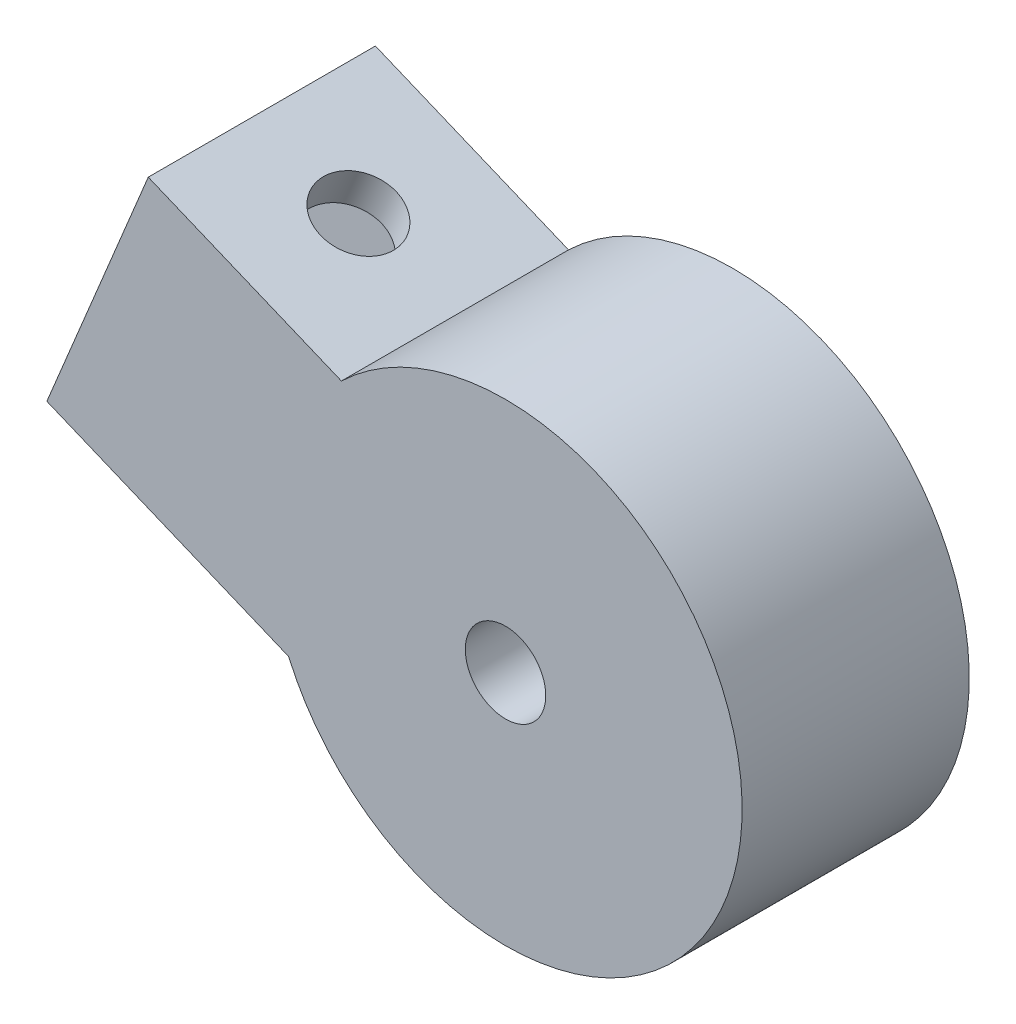
ISO-10303-21;
HEADER;
FILE_DESCRIPTION(('STEP AP214'),'2;1');
FILE_NAME('part.step','',(''),(''),'','','');
FILE_SCHEMA(('AUTOMOTIVE_DESIGN { 1 0 10303 214 1 1 1 1 }'));
ENDSEC;
DATA;
#1=APPLICATION_CONTEXT('core data for automotive mechanical design processes');
#2=APPLICATION_PROTOCOL_DEFINITION('international standard','automotive_design',2000,#1);
#3=PRODUCT_CONTEXT('',#1,'mechanical');
#4=PRODUCT('Part','Part','',(#3));
#5=PRODUCT_RELATED_PRODUCT_CATEGORY('part','',(#4));
#6=PRODUCT_DEFINITION_FORMATION('','',#4);
#7=PRODUCT_DEFINITION_CONTEXT('part definition',#1,'design');
#8=PRODUCT_DEFINITION('design','',#6,#7);
#9=PRODUCT_DEFINITION_SHAPE('','',#8);
#10=(LENGTH_UNIT() NAMED_UNIT(*) SI_UNIT(.MILLI.,.METRE.));
#11=(NAMED_UNIT(*) PLANE_ANGLE_UNIT() SI_UNIT($,.RADIAN.));
#12=(NAMED_UNIT(*) SI_UNIT($,.STERADIAN.) SOLID_ANGLE_UNIT());
#13=UNCERTAINTY_MEASURE_WITH_UNIT(LENGTH_MEASURE(1.E-05),#10,'distance_accuracy_value','');
#14=(GEOMETRIC_REPRESENTATION_CONTEXT(3) GLOBAL_UNCERTAINTY_ASSIGNED_CONTEXT((#13)) GLOBAL_UNIT_ASSIGNED_CONTEXT((#10,
#11,#12)) REPRESENTATION_CONTEXT('',''));
#15=CARTESIAN_POINT('',(0.,0.,0.));
#16=DIRECTION('',(0.,0.,1.));
#17=DIRECTION('',(1.,0.,0.));
#18=AXIS2_PLACEMENT_3D('',#15,#16,#17);
#19=CARTESIAN_POINT('',(0.,0.,12.));
#20=DIRECTION('',(0.,0.,-1.));
#21=DIRECTION('',(-1.,0.,0.));
#22=AXIS2_PLACEMENT_3D('',#19,#20,#21);
#23=CYLINDRICAL_SURFACE('',#22,12.5);
#24=DIRECTION('',(0.,0.,-1.));
#25=VECTOR('',#24,1.);
#26=CARTESIAN_POINT('',(-11.458506301557,-4.99526108798895,12.));
#27=LINE('',#26,#25);
#28=CARTESIAN_POINT('',(-11.4585063015571,-4.99526108798898,12.));
#29=VERTEX_POINT('',#28);
#30=CARTESIAN_POINT('',(-11.458506301557,-4.99526108798895,0.));
#31=VERTEX_POINT('',#30);
#32=EDGE_CURVE('E186',#29,#31,#27,.T.);
#33=ORIENTED_EDGE('',*,*,#32,.T.);
#34=CARTESIAN_POINT('',(0.,0.,0.));
#35=DIRECTION('',(0.,0.,1.));
#36=DIRECTION('',(1.,0.,0.));
#37=AXIS2_PLACEMENT_3D('',#34,#35,#36);
#38=CIRCLE('',#37,12.5);
#39=CARTESIAN_POINT('',(-8.67095256505801,9.00358715260279,0.));
#40=VERTEX_POINT('',#39);
#41=EDGE_CURVE('E47',#31,#40,#38,.T.);
#42=ORIENTED_EDGE('',*,*,#41,.T.);
#43=DIRECTION('',(0.,0.,-1.));
#44=VECTOR('',#43,1.);
#45=CARTESIAN_POINT('',(-8.67095256505799,9.00358715260276,12.));
#46=LINE('',#45,#44);
#47=CARTESIAN_POINT('',(-8.67095256505801,9.00358715260279,12.));
#48=VERTEX_POINT('',#47);
#49=EDGE_CURVE('E182',#48,#40,#46,.T.);
#50=ORIENTED_EDGE('',*,*,#49,.F.);
#51=CARTESIAN_POINT('',(0.,0.,12.));
#52=DIRECTION('',(0.,0.,1.));
#53=DIRECTION('',(1.,0.,0.));
#54=AXIS2_PLACEMENT_3D('',#51,#52,#53);
#55=CIRCLE('',#54,12.5);
#56=EDGE_CURVE('E11',#29,#48,#55,.T.);
#57=ORIENTED_EDGE('',*,*,#56,.F.);
#58=EDGE_LOOP('',(#33,#42,#50,#57));
#59=FACE_BOUND('',#58,.T.);
#60=ADVANCED_FACE('F38',(#59),#23,.T.);
#61=CARTESIAN_POINT('',(0.,0.,12.));
#62=DIRECTION('',(0.,0.,1.));
#63=DIRECTION('',(1.,0.,0.));
#64=AXIS2_PLACEMENT_3D('',#61,#62,#63);
#65=PLANE('',#64);
#66=CARTESIAN_POINT('',(0.,0.,12.));
#67=DIRECTION('',(0.,0.,-1.));
#68=DIRECTION('',(-1.,0.,0.));
#69=AXIS2_PLACEMENT_3D('',#66,#67,#68);
#70=CIRCLE('',#69,2.125);
#71=CARTESIAN_POINT('',(-2.125,0.,12.));
#72=VERTEX_POINT('',#71);
#73=EDGE_CURVE('E231',#72,#72,#70,.T.);
#74=ORIENTED_EDGE('',*,*,#73,.T.);
#75=EDGE_LOOP('',(#74));
#76=FACE_BOUND('',#75,.T.);
#77=ORIENTED_EDGE('',*,*,#56,.T.);
#78=DIRECTION('',(-0.923879532511287,0.382683432365091,0.));
#79=VECTOR('',#78,1.);
#80=CARTESIAN_POINT('',(-18.8738723196785,13.229774890771,12.));
#81=LINE('',#80,#79);
#82=CARTESIAN_POINT('',(-18.8738723196785,13.229774890771,12.));
#83=VERTEX_POINT('',#82);
#84=EDGE_CURVE('E166',#48,#83,#81,.T.);
#85=ORIENTED_EDGE('',*,*,#84,.T.);
#86=DIRECTION('',(-0.382683432365091,-0.923879532511286,0.));
#87=VECTOR('',#86,1.);
#88=CARTESIAN_POINT('',(-20.7872894815039,8.61037722821454,12.));
#89=LINE('',#88,#87);
#90=CARTESIAN_POINT('',(-24.2314403727898,0.295461435612961,12.));
#91=VERTEX_POINT('',#90);
#92=EDGE_CURVE('E158',#83,#91,#89,.T.);
#93=ORIENTED_EDGE('',*,*,#92,.T.);
#94=DIRECTION('',(0.923879532511289,-0.382683432365084,0.));
#95=VECTOR('',#94,1.);
#96=CARTESIAN_POINT('',(-24.2314403727898,0.295461435612961,12.));
#97=LINE('',#96,#95);
#98=EDGE_CURVE('E162',#91,#29,#97,.T.);
#99=ORIENTED_EDGE('',*,*,#98,.T.);
#100=EDGE_LOOP('',(#77,#85,#93,#99));
#101=FACE_BOUND('',#100,.T.);
#102=ADVANCED_FACE('F207',(#76,#101),#65,.T.);
#103=CARTESIAN_POINT('',(0.,0.,0.));
#104=DIRECTION('',(0.,0.,1.));
#105=DIRECTION('',(1.,0.,0.));
#106=AXIS2_PLACEMENT_3D('',#103,#104,#105);
#107=PLANE('',#106);
#108=CARTESIAN_POINT('',(0.,0.,0.));
#109=DIRECTION('',(0.,0.,-1.));
#110=DIRECTION('',(-1.,0.,0.));
#111=AXIS2_PLACEMENT_3D('',#108,#109,#110);
#112=CIRCLE('',#111,6.125);
#113=CARTESIAN_POINT('',(-6.125,0.,0.));
#114=VERTEX_POINT('',#113);
#115=EDGE_CURVE('E234',#114,#114,#112,.T.);
#116=ORIENTED_EDGE('',*,*,#115,.F.);
#117=EDGE_LOOP('',(#116));
#118=FACE_BOUND('',#117,.T.);
#119=ORIENTED_EDGE('',*,*,#41,.F.);
#120=DIRECTION('',(0.923879532511289,-0.382683432365084,0.));
#121=VECTOR('',#120,1.);
#122=CARTESIAN_POINT('',(-24.2314403727898,0.295461435612961,0.));
#123=LINE('',#122,#121);
#124=CARTESIAN_POINT('',(-24.2314403727898,0.295461435612961,0.));
#125=VERTEX_POINT('',#124);
#126=EDGE_CURVE('E152',#125,#31,#123,.T.);
#127=ORIENTED_EDGE('',*,*,#126,.F.);
#128=DIRECTION('',(-0.38268343236509,-0.923879532511286,0.));
#129=VECTOR('',#128,1.);
#130=CARTESIAN_POINT('',(-20.7872894815039,8.61037722821454,0.));
#131=LINE('',#130,#129);
#132=CARTESIAN_POINT('',(-18.8738723196785,13.229774890771,0.));
#133=VERTEX_POINT('',#132);
#134=EDGE_CURVE('E163',#133,#125,#131,.T.);
#135=ORIENTED_EDGE('',*,*,#134,.F.);
#136=DIRECTION('',(-0.923879532511287,0.382683432365091,0.));
#137=VECTOR('',#136,1.);
#138=CARTESIAN_POINT('',(-18.8738723196785,13.229774890771,0.));
#139=LINE('',#138,#137);
#140=EDGE_CURVE('E174',#40,#133,#139,.T.);
#141=ORIENTED_EDGE('',*,*,#140,.F.);
#142=EDGE_LOOP('',(#119,#127,#135,#141));
#143=FACE_BOUND('',#142,.T.);
#144=ADVANCED_FACE('F202',(#118,#143),#107,.F.);
#145=CARTESIAN_POINT('',(-24.2314403727898,0.295461435612961,12.));
#146=DIRECTION('',(0.382683432365084,0.923879532511289,0.));
#147=DIRECTION('',(-0.923879532511289,0.382683432365084,0.));
#148=AXIS2_PLACEMENT_3D('',#145,#146,#147);
#149=PLANE('',#148);
#150=CARTESIAN_POINT('',(-19.1299804954795,-1.8176324334711,6.));
#151=DIRECTION('',(0.382683432365084,0.923879532511289,0.));
#152=DIRECTION('',(-0.923879532511289,0.382683432365084,0.));
#153=AXIS2_PLACEMENT_3D('',#150,#151,#152);
#154=CIRCLE('',#153,2.);
#155=CARTESIAN_POINT('',(-20.9777395605021,-1.05226556874093,6.));
#156=VERTEX_POINT('',#155);
#157=EDGE_CURVE('E251',#156,#156,#154,.F.);
#158=ORIENTED_EDGE('',*,*,#157,.F.);
#159=EDGE_LOOP('',(#158));
#160=FACE_BOUND('',#159,.T.);
#161=ORIENTED_EDGE('',*,*,#126,.T.);
#162=ORIENTED_EDGE('',*,*,#32,.F.);
#163=ORIENTED_EDGE('',*,*,#98,.F.);
#164=DIRECTION('',(0.,0.,-1.));
#165=VECTOR('',#164,1.);
#166=CARTESIAN_POINT('',(-24.2314403727898,0.295461435612961,12.));
#167=LINE('',#166,#165);
#168=EDGE_CURVE('E189',#91,#125,#167,.T.);
#169=ORIENTED_EDGE('',*,*,#168,.T.);
#170=EDGE_LOOP('',(#161,#162,#163,#169));
#171=FACE_BOUND('',#170,.T.);
#172=ADVANCED_FACE('F209',(#160,#171),#149,.F.);
#173=CARTESIAN_POINT('',(-18.8738723196785,13.229774890771,12.));
#174=DIRECTION('',(-0.382683432365091,-0.923879532511286,0.));
#175=DIRECTION('',(0.923879532511287,-0.382683432365091,0.));
#176=AXIS2_PLACEMENT_3D('',#173,#174,#175);
#177=PLANE('',#176);
#178=CARTESIAN_POINT('',(-13.7724124423683,11.1166810216869,6.));
#179=DIRECTION('',(0.382683432365091,0.923879532511286,0.));
#180=DIRECTION('',(-0.923879532511286,0.382683432365091,0.));
#181=AXIS2_PLACEMENT_3D('',#178,#179,#180);
#182=CIRCLE('',#181,2.);
#183=CARTESIAN_POINT('',(-15.6201715073908,11.8820478864171,6.));
#184=VERTEX_POINT('',#183);
#185=EDGE_CURVE('E247',#184,#184,#182,.T.);
#186=ORIENTED_EDGE('',*,*,#185,.F.);
#187=EDGE_LOOP('',(#186));
#188=FACE_BOUND('',#187,.T.);
#189=ORIENTED_EDGE('',*,*,#140,.T.);
#190=DIRECTION('',(0.,0.,-1.));
#191=VECTOR('',#190,1.);
#192=CARTESIAN_POINT('',(-18.8738723196785,13.229774890771,12.));
#193=LINE('',#192,#191);
#194=EDGE_CURVE('E170',#83,#133,#193,.T.);
#195=ORIENTED_EDGE('',*,*,#194,.F.);
#196=ORIENTED_EDGE('',*,*,#84,.F.);
#197=ORIENTED_EDGE('',*,*,#49,.T.);
#198=EDGE_LOOP('',(#189,#195,#196,#197));
#199=FACE_BOUND('',#198,.T.);
#200=ADVANCED_FACE('F199',(#188,#199),#177,.F.);
#201=CARTESIAN_POINT('',(-20.7872894815039,8.61037722821454,12.));
#202=DIRECTION('',(0.923879532511287,-0.382683432365091,0.));
#203=DIRECTION('',(0.382683432365091,0.923879532511287,0.));
#204=AXIS2_PLACEMENT_3D('',#201,#202,#203);
#205=PLANE('',#204);
#206=DIRECTION('',(0.,0.,1.));
#207=VECTOR('',#206,1.);
#208=CARTESIAN_POINT('',(-23.4660735080596,2.14322050063554,2.));
#209=LINE('',#208,#207);
#210=CARTESIAN_POINT('',(-23.4660735080596,2.14322050063554,2.));
#211=VERTEX_POINT('',#210);
#212=CARTESIAN_POINT('',(-23.4660735080596,2.14322050063554,10.));
#213=VERTEX_POINT('',#212);
#214=EDGE_CURVE('E143',#211,#213,#209,.T.);
#215=ORIENTED_EDGE('',*,*,#214,.F.);
#216=DIRECTION('',(-0.382683432365091,-0.923879532511287,0.));
#217=VECTOR('',#216,1.);
#218=CARTESIAN_POINT('',(-19.6392391844087,11.3820158257484,2.));
#219=LINE('',#218,#217);
#220=CARTESIAN_POINT('',(-19.6392391844087,11.3820158257484,2.));
#221=VERTEX_POINT('',#220);
#222=EDGE_CURVE('E55',#221,#211,#219,.T.);
#223=ORIENTED_EDGE('',*,*,#222,.F.);
#224=DIRECTION('',(0.,0.,-1.));
#225=VECTOR('',#224,1.);
#226=CARTESIAN_POINT('',(-19.6392391844087,11.3820158257484,2.));
#227=LINE('',#226,#225);
#228=CARTESIAN_POINT('',(-19.6392391844087,11.3820158257484,10.));
#229=VERTEX_POINT('',#228);
#230=EDGE_CURVE('E127',#229,#221,#227,.T.);
#231=ORIENTED_EDGE('',*,*,#230,.F.);
#232=DIRECTION('',(0.382683432365091,0.923879532511287,0.));
#233=VECTOR('',#232,1.);
#234=CARTESIAN_POINT('',(-19.6392391844087,11.3820158257484,10.));
#235=LINE('',#234,#233);
#236=EDGE_CURVE('E131',#213,#229,#235,.T.);
#237=ORIENTED_EDGE('',*,*,#236,.F.);
#238=EDGE_LOOP('',(#215,#223,#231,#237));
#239=FACE_BOUND('',#238,.T.);
#240=ORIENTED_EDGE('',*,*,#134,.T.);
#241=ORIENTED_EDGE('',*,*,#168,.F.);
#242=ORIENTED_EDGE('',*,*,#92,.F.);
#243=ORIENTED_EDGE('',*,*,#194,.T.);
#244=EDGE_LOOP('',(#240,#241,#242,#243));
#245=FACE_BOUND('',#244,.T.);
#246=ADVANCED_FACE('F205',(#239,#245),#205,.F.);
#247=CARTESIAN_POINT('',(-10.4004438592958,7.5551815020975,2.));
#248=DIRECTION('',(0.,0.,-1.));
#249=DIRECTION('',(0.,1.,0.));
#250=AXIS2_PLACEMENT_3D('',#247,#248,#249);
#251=PLANE('',#250);
#252=ORIENTED_EDGE('',*,*,#222,.T.);
#253=DIRECTION('',(-0.923879532511287,0.382683432365091,0.));
#254=VECTOR('',#253,1.);
#255=CARTESIAN_POINT('',(-14.2272781829467,-1.68361382301537,2.));
#256=LINE('',#255,#254);
#257=CARTESIAN_POINT('',(-14.2272781829467,-1.68361382301537,2.));
#258=VERTEX_POINT('',#257);
#259=EDGE_CURVE('E102',#258,#211,#256,.T.);
#260=ORIENTED_EDGE('',*,*,#259,.F.);
#261=DIRECTION('',(-0.382683432365091,-0.923879532511287,0.));
#262=VECTOR('',#261,1.);
#263=CARTESIAN_POINT('',(-10.4004438592958,7.5551815020975,2.));
#264=LINE('',#263,#262);
#265=CARTESIAN_POINT('',(-10.4004438592958,7.5551815020975,2.));
#266=VERTEX_POINT('',#265);
#267=EDGE_CURVE('E106',#266,#258,#264,.T.);
#268=ORIENTED_EDGE('',*,*,#267,.F.);
#269=DIRECTION('',(-0.923879532511287,0.382683432365091,0.));
#270=VECTOR('',#269,1.);
#271=CARTESIAN_POINT('',(-10.4004438592958,7.5551815020975,2.));
#272=LINE('',#271,#270);
#273=EDGE_CURVE('E149',#266,#221,#272,.T.);
#274=ORIENTED_EDGE('',*,*,#273,.T.);
#275=EDGE_LOOP('',(#252,#260,#268,#274));
#276=FACE_BOUND('',#275,.T.);
#277=ADVANCED_FACE('F104',(#276),#251,.F.);
#278=CARTESIAN_POINT('',(-10.4004438592958,7.5551815020975,2.));
#279=DIRECTION('',(0.382683432365091,0.923879532511287,0.));
#280=DIRECTION('',(-0.923879532511287,0.382683432365091,0.));
#281=AXIS2_PLACEMENT_3D('',#278,#279,#280);
#282=PLANE('',#281);
#283=CARTESIAN_POINT('',(-14.5377793070984,9.26892195666431,6.));
#284=DIRECTION('',(0.382683432365091,0.923879532511287,0.));
#285=DIRECTION('',(-0.923879532511287,0.382683432365091,0.));
#286=AXIS2_PLACEMENT_3D('',#283,#284,#285);
#287=CIRCLE('',#286,2.);
#288=CARTESIAN_POINT('',(-16.385538372121,10.0342888213945,6.));
#289=VERTEX_POINT('',#288);
#290=EDGE_CURVE('E134',#289,#289,#287,.T.);
#291=ORIENTED_EDGE('',*,*,#290,.T.);
#292=EDGE_LOOP('',(#291));
#293=FACE_BOUND('',#292,.T.);
#294=ORIENTED_EDGE('',*,*,#230,.T.);
#295=ORIENTED_EDGE('',*,*,#273,.F.);
#296=DIRECTION('',(0.,0.,-1.));
#297=VECTOR('',#296,1.);
#298=CARTESIAN_POINT('',(-10.4004438592958,7.5551815020975,2.));
#299=LINE('',#298,#297);
#300=CARTESIAN_POINT('',(-10.4004438592958,7.5551815020975,10.));
#301=VERTEX_POINT('',#300);
#302=EDGE_CURVE('E113',#301,#266,#299,.T.);
#303=ORIENTED_EDGE('',*,*,#302,.F.);
#304=DIRECTION('',(-0.923879532511287,0.382683432365091,0.));
#305=VECTOR('',#304,1.);
#306=CARTESIAN_POINT('',(-10.4004438592958,7.5551815020975,10.));
#307=LINE('',#306,#305);
#308=EDGE_CURVE('E153',#301,#229,#307,.T.);
#309=ORIENTED_EDGE('',*,*,#308,.T.);
#310=EDGE_LOOP('',(#294,#295,#303,#309));
#311=FACE_BOUND('',#310,.T.);
#312=ADVANCED_FACE('F263',(#293,#311),#282,.F.);
#313=CARTESIAN_POINT('',(-10.4004438592958,7.5551815020975,10.));
#314=DIRECTION('',(0.,0.,1.));
#315=DIRECTION('',(0.,-1.,0.));
#316=AXIS2_PLACEMENT_3D('',#313,#314,#315);
#317=PLANE('',#316);
#318=ORIENTED_EDGE('',*,*,#236,.T.);
#319=ORIENTED_EDGE('',*,*,#308,.F.);
#320=DIRECTION('',(0.382683432365091,0.923879532511287,0.));
#321=VECTOR('',#320,1.);
#322=CARTESIAN_POINT('',(-10.4004438592958,7.5551815020975,10.));
#323=LINE('',#322,#321);
#324=CARTESIAN_POINT('',(-14.2272781829467,-1.68361382301537,10.));
#325=VERTEX_POINT('',#324);
#326=EDGE_CURVE('E122',#325,#301,#323,.T.);
#327=ORIENTED_EDGE('',*,*,#326,.F.);
#328=DIRECTION('',(-0.923879532511287,0.382683432365091,0.));
#329=VECTOR('',#328,1.);
#330=CARTESIAN_POINT('',(-14.2272781829467,-1.68361382301537,10.));
#331=LINE('',#330,#329);
#332=EDGE_CURVE('E112',#325,#213,#331,.T.);
#333=ORIENTED_EDGE('',*,*,#332,.T.);
#334=EDGE_LOOP('',(#318,#319,#327,#333));
#335=FACE_BOUND('',#334,.T.);
#336=ADVANCED_FACE('F285',(#335),#317,.F.);
#337=CARTESIAN_POINT('',(-14.2272781829467,-1.68361382301537,2.));
#338=DIRECTION('',(-0.382683432365091,-0.923879532511287,0.));
#339=DIRECTION('',(0.923879532511287,-0.382683432365091,0.));
#340=AXIS2_PLACEMENT_3D('',#337,#338,#339);
#341=PLANE('',#340);
#342=CARTESIAN_POINT('',(-18.3646136307493,0.0301266315514423,6.));
#343=DIRECTION('',(-0.382683432365091,-0.923879532511287,0.));
#344=DIRECTION('',(0.923879532511287,-0.382683432365091,0.));
#345=AXIS2_PLACEMENT_3D('',#342,#343,#344);
#346=CIRCLE('',#345,2.);
#347=CARTESIAN_POINT('',(-16.5168545657268,-0.735240233178739,6.));
#348=VERTEX_POINT('',#347);
#349=EDGE_CURVE('E41',#348,#348,#346,.T.);
#350=ORIENTED_EDGE('',*,*,#349,.T.);
#351=EDGE_LOOP('',(#350));
#352=FACE_BOUND('',#351,.T.);
#353=ORIENTED_EDGE('',*,*,#214,.T.);
#354=ORIENTED_EDGE('',*,*,#332,.F.);
#355=DIRECTION('',(0.,0.,1.));
#356=VECTOR('',#355,1.);
#357=CARTESIAN_POINT('',(-14.2272781829467,-1.68361382301537,2.));
#358=LINE('',#357,#356);
#359=EDGE_CURVE('E116',#258,#325,#358,.T.);
#360=ORIENTED_EDGE('',*,*,#359,.F.);
#361=ORIENTED_EDGE('',*,*,#259,.T.);
#362=EDGE_LOOP('',(#353,#354,#360,#361));
#363=FACE_BOUND('',#362,.T.);
#364=ADVANCED_FACE('F117',(#352,#363),#341,.F.);
#365=CARTESIAN_POINT('',(-11.5484941563911,4.78354290456364,0.));
#366=DIRECTION('',(-0.923879532511287,0.382683432365091,0.));
#367=DIRECTION('',(-0.382683432365091,-0.923879532511287,0.));
#368=AXIS2_PLACEMENT_3D('',#365,#366,#367);
#369=PLANE('',#368);
#370=ORIENTED_EDGE('',*,*,#267,.T.);
#371=ORIENTED_EDGE('',*,*,#359,.T.);
#372=ORIENTED_EDGE('',*,*,#326,.T.);
#373=ORIENTED_EDGE('',*,*,#302,.T.);
#374=EDGE_LOOP('',(#370,#371,#372,#373));
#375=FACE_BOUND('',#374,.T.);
#376=ADVANCED_FACE('F124',(#375),#369,.T.);
#377=CARTESIAN_POINT('',(-21.2947648960643,-7.0438842929766,6.));
#378=DIRECTION('',(0.382683432365091,0.923879532511286,0.));
#379=DIRECTION('',(-0.923879532511286,0.382683432365091,0.));
#380=AXIS2_PLACEMENT_3D('',#377,#378,#379);
#381=CYLINDRICAL_SURFACE('',#380,2.);
#382=ORIENTED_EDGE('',*,*,#157,.T.);
#383=EDGE_LOOP('',(#382));
#384=FACE_BOUND('',#383,.T.);
#385=ORIENTED_EDGE('',*,*,#349,.F.);
#386=EDGE_LOOP('',(#385));
#387=FACE_BOUND('',#386,.T.);
#388=ADVANCED_FACE('F269',(#384,#387),#381,.F.);
#389=ORIENTED_EDGE('',*,*,#185,.T.);
#390=EDGE_LOOP('',(#389));
#391=FACE_BOUND('',#390,.T.);
#392=ORIENTED_EDGE('',*,*,#290,.F.);
#393=EDGE_LOOP('',(#392));
#394=FACE_BOUND('',#393,.T.);
#395=ADVANCED_FACE('F266',(#391,#394),#381,.F.);
#396=CARTESIAN_POINT('',(0.,0.,4.));
#397=DIRECTION('',(0.,0.,-1.));
#398=DIRECTION('',(-1.,0.,0.));
#399=AXIS2_PLACEMENT_3D('',#396,#397,#398);
#400=CYLINDRICAL_SURFACE('',#399,6.125);
#401=CARTESIAN_POINT('',(0.,0.,4.));
#402=DIRECTION('',(0.,0.,-1.));
#403=DIRECTION('',(-1.,0.,0.));
#404=AXIS2_PLACEMENT_3D('',#401,#402,#403);
#405=CIRCLE('',#404,6.125);
#406=CARTESIAN_POINT('',(-6.125,0.,4.));
#407=VERTEX_POINT('',#406);
#408=EDGE_CURVE('E240',#407,#407,#405,.T.);
#409=ORIENTED_EDGE('',*,*,#408,.F.);
#410=EDGE_LOOP('',(#409));
#411=FACE_BOUND('',#410,.T.);
#412=ORIENTED_EDGE('',*,*,#115,.T.);
#413=EDGE_LOOP('',(#412));
#414=FACE_BOUND('',#413,.T.);
#415=ADVANCED_FACE('F268',(#411,#414),#400,.F.);
#416=CARTESIAN_POINT('',(0.,0.,4.));
#417=DIRECTION('',(0.,0.,-1.));
#418=DIRECTION('',(-1.,0.,0.));
#419=AXIS2_PLACEMENT_3D('',#416,#417,#418);
#420=PLANE('',#419);
#421=CARTESIAN_POINT('',(0.,0.,4.));
#422=DIRECTION('',(0.,0.,-1.));
#423=DIRECTION('',(-1.,0.,0.));
#424=AXIS2_PLACEMENT_3D('',#421,#422,#423);
#425=CIRCLE('',#424,2.125);
#426=CARTESIAN_POINT('',(-2.125,0.,4.));
#427=VERTEX_POINT('',#426);
#428=EDGE_CURVE('E235',#427,#427,#425,.T.);
#429=ORIENTED_EDGE('',*,*,#428,.F.);
#430=EDGE_LOOP('',(#429));
#431=FACE_BOUND('',#430,.T.);
#432=ORIENTED_EDGE('',*,*,#408,.T.);
#433=EDGE_LOOP('',(#432));
#434=FACE_BOUND('',#433,.T.);
#435=ADVANCED_FACE('F276',(#431,#434),#420,.T.);
#436=CARTESIAN_POINT('',(0.,0.,12.));
#437=DIRECTION('',(0.,0.,-1.));
#438=DIRECTION('',(-1.,0.,0.));
#439=AXIS2_PLACEMENT_3D('',#436,#437,#438);
#440=CYLINDRICAL_SURFACE('',#439,2.125);
#441=ORIENTED_EDGE('',*,*,#73,.F.);
#442=EDGE_LOOP('',(#441));
#443=FACE_BOUND('',#442,.T.);
#444=ORIENTED_EDGE('',*,*,#428,.T.);
#445=EDGE_LOOP('',(#444));
#446=FACE_BOUND('',#445,.T.);
#447=ADVANCED_FACE('F358',(#443,#446),#440,.F.);
#448=CLOSED_SHELL('',(#60,#102,#144,#172,#200,#246,#277,#312,#336,#364,#376,#388,#395,#415,#435,#447));
#449=MANIFOLD_SOLID_BREP('B2',#448);
#450=ADVANCED_BREP_SHAPE_REPRESENTATION('',(#18,#449),#14);
#451=SHAPE_DEFINITION_REPRESENTATION(#9,#450);
ENDSEC;
END-ISO-10303-21;
